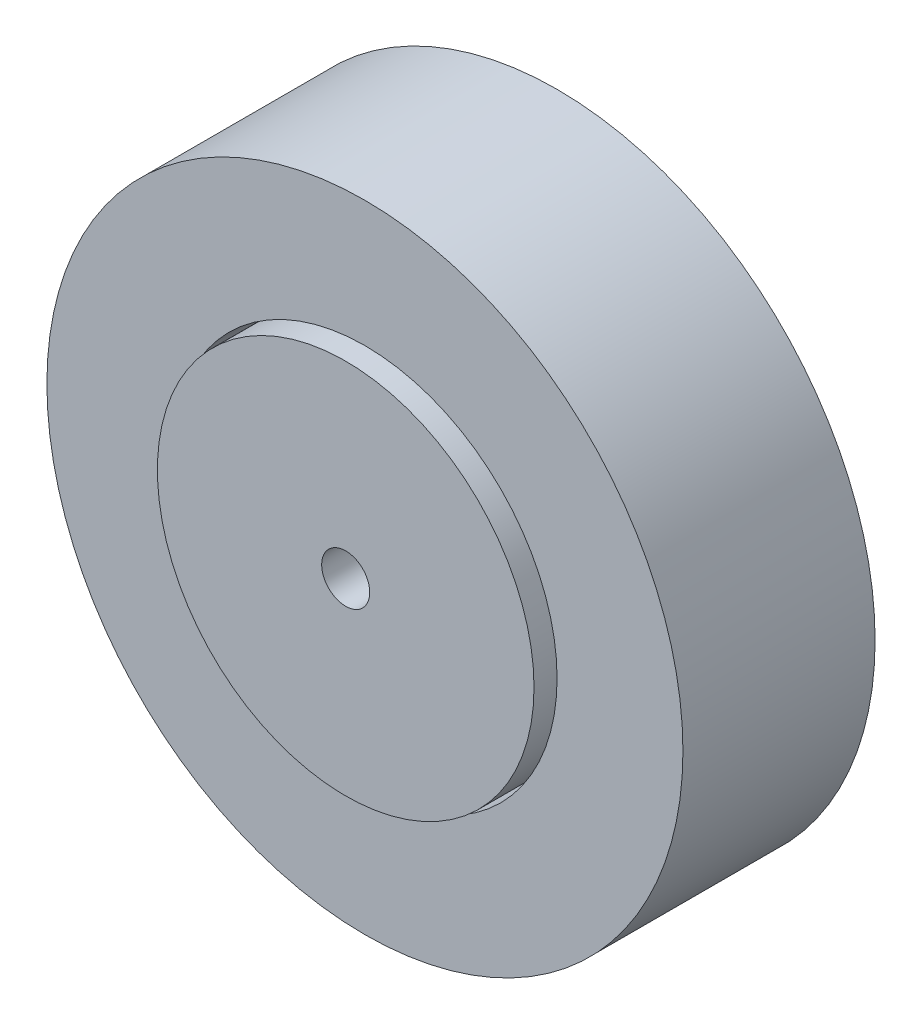
ISO-10303-21;
HEADER;
FILE_DESCRIPTION(('STEP AP214'),'2;1');
FILE_NAME('part.step','',(''),(''),'','','');
FILE_SCHEMA(('AUTOMOTIVE_DESIGN { 1 0 10303 214 1 1 1 1 }'));
ENDSEC;
DATA;
#1=APPLICATION_CONTEXT('core data for automotive mechanical design processes');
#2=APPLICATION_PROTOCOL_DEFINITION('international standard','automotive_design',2000,#1);
#3=PRODUCT_CONTEXT('',#1,'mechanical');
#4=PRODUCT('Part','Part','',(#3));
#5=PRODUCT_RELATED_PRODUCT_CATEGORY('part','',(#4));
#6=PRODUCT_DEFINITION_FORMATION('','',#4);
#7=PRODUCT_DEFINITION_CONTEXT('part definition',#1,'design');
#8=PRODUCT_DEFINITION('design','',#6,#7);
#9=PRODUCT_DEFINITION_SHAPE('','',#8);
#10=(LENGTH_UNIT() NAMED_UNIT(*) SI_UNIT(.MILLI.,.METRE.));
#11=(NAMED_UNIT(*) PLANE_ANGLE_UNIT() SI_UNIT($,.RADIAN.));
#12=(NAMED_UNIT(*) SI_UNIT($,.STERADIAN.) SOLID_ANGLE_UNIT());
#13=UNCERTAINTY_MEASURE_WITH_UNIT(LENGTH_MEASURE(1.E-05),#10,'distance_accuracy_value','');
#14=(GEOMETRIC_REPRESENTATION_CONTEXT(3) GLOBAL_UNCERTAINTY_ASSIGNED_CONTEXT((#13)) GLOBAL_UNIT_ASSIGNED_CONTEXT((#10,
#11,#12)) REPRESENTATION_CONTEXT('',''));
#15=CARTESIAN_POINT('',(0.,0.,0.));
#16=DIRECTION('',(0.,0.,1.));
#17=DIRECTION('',(1.,0.,0.));
#18=AXIS2_PLACEMENT_3D('',#15,#16,#17);
#19=CARTESIAN_POINT('',(0.,0.,6.35));
#20=DIRECTION('',(0.,0.,1.));
#21=DIRECTION('',(1.,0.,0.));
#22=AXIS2_PLACEMENT_3D('',#19,#20,#21);
#23=PLANE('',#22);
#24=CARTESIAN_POINT('',(0.,0.,6.35));
#25=DIRECTION('',(0.,0.,1.));
#26=DIRECTION('',(1.,0.,0.));
#27=AXIS2_PLACEMENT_3D('',#24,#25,#26);
#28=CIRCLE('',#27,21.0185);
#29=CARTESIAN_POINT('',(21.0185,0.,6.35));
#30=VERTEX_POINT('',#29);
#31=EDGE_CURVE('E11',#30,#30,#28,.T.);
#32=ORIENTED_EDGE('',*,*,#31,.T.);
#33=EDGE_LOOP('',(#32));
#34=FACE_BOUND('',#33,.T.);
#35=CARTESIAN_POINT('',(0.,0.,6.35));
#36=DIRECTION('',(0.,0.,1.));
#37=DIRECTION('',(1.,0.,0.));
#38=AXIS2_PLACEMENT_3D('',#35,#36,#37);
#39=CIRCLE('',#38,12.7);
#40=CARTESIAN_POINT('',(12.7,0.,6.35));
#41=VERTEX_POINT('',#40);
#42=EDGE_CURVE('E51',#41,#41,#39,.T.);
#43=ORIENTED_EDGE('',*,*,#42,.F.);
#44=EDGE_LOOP('',(#43));
#45=FACE_BOUND('',#44,.T.);
#46=ADVANCED_FACE('F40',(#34,#45),#23,.T.);
#47=CARTESIAN_POINT('',(0.,0.,-6.35));
#48=DIRECTION('',(0.,0.,1.));
#49=DIRECTION('',(1.,0.,0.));
#50=AXIS2_PLACEMENT_3D('',#47,#48,#49);
#51=PLANE('',#50);
#52=CARTESIAN_POINT('',(0.,0.,-6.35));
#53=DIRECTION('',(0.,0.,1.));
#54=DIRECTION('',(1.,0.,0.));
#55=AXIS2_PLACEMENT_3D('',#52,#53,#54);
#56=CIRCLE('',#55,21.0185);
#57=CARTESIAN_POINT('',(21.0185,0.,-6.35));
#58=VERTEX_POINT('',#57);
#59=EDGE_CURVE('E44',#58,#58,#56,.T.);
#60=ORIENTED_EDGE('',*,*,#59,.F.);
#61=EDGE_LOOP('',(#60));
#62=FACE_BOUND('',#61,.T.);
#63=CARTESIAN_POINT('',(0.,0.,-6.35));
#64=DIRECTION('',(0.,0.,1.));
#65=DIRECTION('',(1.,0.,0.));
#66=AXIS2_PLACEMENT_3D('',#63,#64,#65);
#67=CIRCLE('',#66,12.7);
#68=CARTESIAN_POINT('',(12.7,0.,-6.35));
#69=VERTEX_POINT('',#68);
#70=EDGE_CURVE('E53',#69,#69,#67,.T.);
#71=ORIENTED_EDGE('',*,*,#70,.T.);
#72=EDGE_LOOP('',(#71));
#73=FACE_BOUND('',#72,.T.);
#74=ADVANCED_FACE('F63',(#62,#73),#51,.F.);
#75=CARTESIAN_POINT('',(0.,0.,6.35));
#76=DIRECTION('',(0.,0.,-1.));
#77=DIRECTION('',(-1.,0.,0.));
#78=AXIS2_PLACEMENT_3D('',#75,#76,#77);
#79=CYLINDRICAL_SURFACE('',#78,21.0185);
#80=ORIENTED_EDGE('',*,*,#31,.F.);
#81=EDGE_LOOP('',(#80));
#82=FACE_BOUND('',#81,.T.);
#83=ORIENTED_EDGE('',*,*,#59,.T.);
#84=EDGE_LOOP('',(#83));
#85=FACE_BOUND('',#84,.T.);
#86=ADVANCED_FACE('F42',(#82,#85),#79,.T.);
#87=CARTESIAN_POINT('',(0.,0.,6.35));
#88=DIRECTION('',(0.,0.,-1.));
#89=DIRECTION('',(-1.,0.,0.));
#90=AXIS2_PLACEMENT_3D('',#87,#88,#89);
#91=CYLINDRICAL_SURFACE('',#90,12.7);
#92=ORIENTED_EDGE('',*,*,#42,.T.);
#93=EDGE_LOOP('',(#92));
#94=FACE_BOUND('',#93,.T.);
#95=ORIENTED_EDGE('',*,*,#70,.F.);
#96=EDGE_LOOP('',(#95));
#97=FACE_BOUND('',#96,.T.);
#98=ADVANCED_FACE('F59',(#94,#97),#91,.F.);
#99=CLOSED_SHELL('',(#46,#74,#86,#98));
#100=MANIFOLD_SOLID_BREP('B2',#99);
#101=CARTESIAN_POINT('',(0.,0.,7.62));
#102=DIRECTION('',(0.,0.,1.));
#103=DIRECTION('',(1.,0.,0.));
#104=AXIS2_PLACEMENT_3D('',#101,#102,#103);
#105=PLANE('',#104);
#106=CARTESIAN_POINT('',(0.,0.,7.62));
#107=DIRECTION('',(0.,0.,1.));
#108=DIRECTION('',(1.,0.,0.));
#109=AXIS2_PLACEMENT_3D('',#106,#107,#108);
#110=CIRCLE('',#109,12.446);
#111=CARTESIAN_POINT('',(12.446,0.,7.62));
#112=VERTEX_POINT('',#111);
#113=EDGE_CURVE('E39',#112,#112,#110,.T.);
#114=ORIENTED_EDGE('',*,*,#113,.T.);
#115=EDGE_LOOP('',(#114));
#116=FACE_BOUND('',#115,.T.);
#117=CARTESIAN_POINT('',(0.,0.,7.62));
#118=DIRECTION('',(0.,0.,1.));
#119=DIRECTION('',(1.,0.,0.));
#120=AXIS2_PLACEMENT_3D('',#117,#118,#119);
#121=CIRCLE('',#120,1.5875);
#122=CARTESIAN_POINT('',(1.5875,0.,7.62));
#123=VERTEX_POINT('',#122);
#124=EDGE_CURVE('E114',#123,#123,#121,.T.);
#125=ORIENTED_EDGE('',*,*,#124,.F.);
#126=EDGE_LOOP('',(#125));
#127=FACE_BOUND('',#126,.T.);
#128=ADVANCED_FACE('F103',(#116,#127),#105,.T.);
#129=CARTESIAN_POINT('',(0.,0.,-7.62));
#130=DIRECTION('',(0.,0.,1.));
#131=DIRECTION('',(1.,0.,0.));
#132=AXIS2_PLACEMENT_3D('',#129,#130,#131);
#133=PLANE('',#132);
#134=CARTESIAN_POINT('',(0.,0.,-7.62));
#135=DIRECTION('',(0.,0.,1.));
#136=DIRECTION('',(1.,0.,0.));
#137=AXIS2_PLACEMENT_3D('',#134,#135,#136);
#138=CIRCLE('',#137,12.446);
#139=CARTESIAN_POINT('',(12.446,0.,-7.62));
#140=VERTEX_POINT('',#139);
#141=EDGE_CURVE('E107',#140,#140,#138,.T.);
#142=ORIENTED_EDGE('',*,*,#141,.F.);
#143=EDGE_LOOP('',(#142));
#144=FACE_BOUND('',#143,.T.);
#145=CARTESIAN_POINT('',(0.,0.,-7.62));
#146=DIRECTION('',(0.,0.,1.));
#147=DIRECTION('',(1.,0.,0.));
#148=AXIS2_PLACEMENT_3D('',#145,#146,#147);
#149=CIRCLE('',#148,1.5875);
#150=CARTESIAN_POINT('',(1.5875,0.,-7.62));
#151=VERTEX_POINT('',#150);
#152=EDGE_CURVE('E116',#151,#151,#149,.T.);
#153=ORIENTED_EDGE('',*,*,#152,.T.);
#154=EDGE_LOOP('',(#153));
#155=FACE_BOUND('',#154,.T.);
#156=ADVANCED_FACE('F126',(#144,#155),#133,.F.);
#157=CARTESIAN_POINT('',(0.,0.,7.62));
#158=DIRECTION('',(0.,0.,-1.));
#159=DIRECTION('',(-1.,0.,0.));
#160=AXIS2_PLACEMENT_3D('',#157,#158,#159);
#161=CYLINDRICAL_SURFACE('',#160,12.446);
#162=ORIENTED_EDGE('',*,*,#113,.F.);
#163=EDGE_LOOP('',(#162));
#164=FACE_BOUND('',#163,.T.);
#165=ORIENTED_EDGE('',*,*,#141,.T.);
#166=EDGE_LOOP('',(#165));
#167=FACE_BOUND('',#166,.T.);
#168=ADVANCED_FACE('F105',(#164,#167),#161,.T.);
#169=CARTESIAN_POINT('',(0.,0.,7.62));
#170=DIRECTION('',(0.,0.,-1.));
#171=DIRECTION('',(-1.,0.,0.));
#172=AXIS2_PLACEMENT_3D('',#169,#170,#171);
#173=CYLINDRICAL_SURFACE('',#172,1.5875);
#174=ORIENTED_EDGE('',*,*,#124,.T.);
#175=EDGE_LOOP('',(#174));
#176=FACE_BOUND('',#175,.T.);
#177=ORIENTED_EDGE('',*,*,#152,.F.);
#178=EDGE_LOOP('',(#177));
#179=FACE_BOUND('',#178,.T.);
#180=ADVANCED_FACE('F122',(#176,#179),#173,.F.);
#181=CLOSED_SHELL('',(#128,#156,#168,#180));
#182=MANIFOLD_SOLID_BREP('B6',#181);
#183=ADVANCED_BREP_SHAPE_REPRESENTATION('',(#18,#100,#182),#14);
#184=SHAPE_DEFINITION_REPRESENTATION(#9,#183);
ENDSEC;
END-ISO-10303-21;
